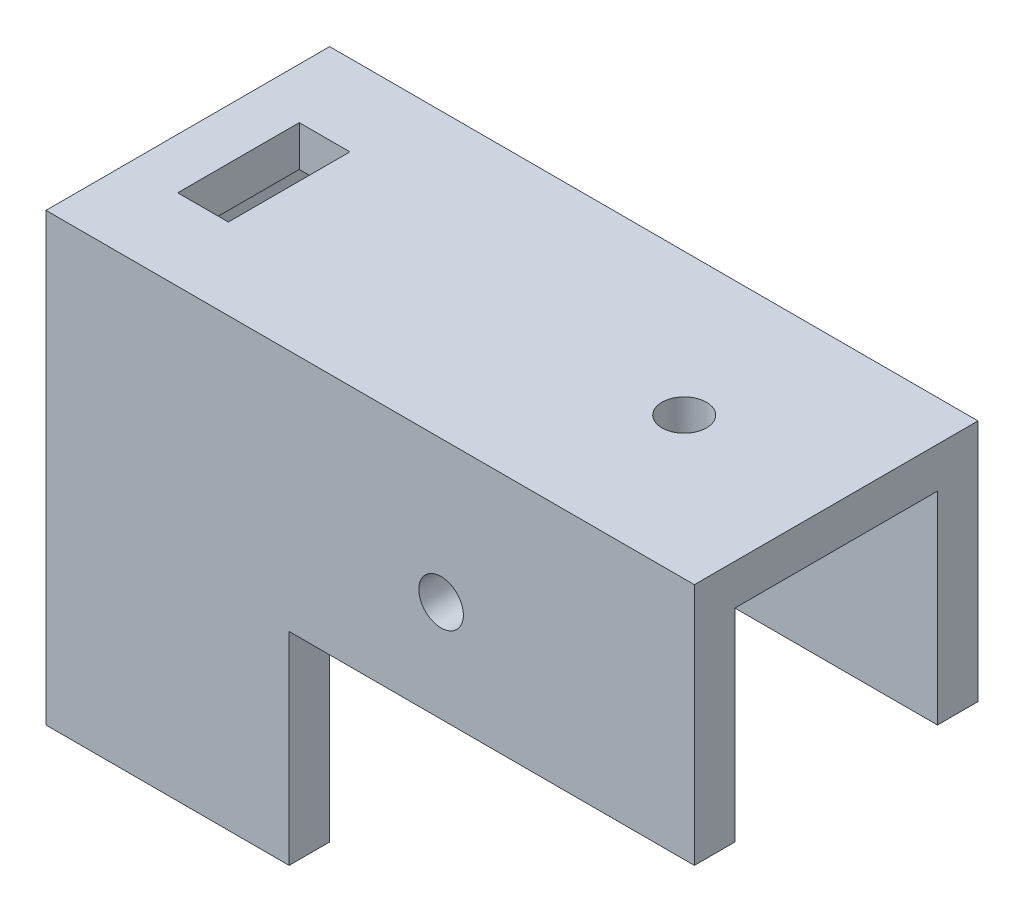
ISO-10303-21;
HEADER;
FILE_DESCRIPTION(('STEP AP214'),'2;1');
FILE_NAME('part.step','',(''),(''),'','','');
FILE_SCHEMA(('AUTOMOTIVE_DESIGN { 1 0 10303 214 1 1 1 1 }'));
ENDSEC;
DATA;
#1=APPLICATION_CONTEXT('core data for automotive mechanical design processes');
#2=APPLICATION_PROTOCOL_DEFINITION('international standard','automotive_design',2000,#1);
#3=PRODUCT_CONTEXT('',#1,'mechanical');
#4=PRODUCT('Part','Part','',(#3));
#5=PRODUCT_RELATED_PRODUCT_CATEGORY('part','',(#4));
#6=PRODUCT_DEFINITION_FORMATION('','',#4);
#7=PRODUCT_DEFINITION_CONTEXT('part definition',#1,'design');
#8=PRODUCT_DEFINITION('design','',#6,#7);
#9=PRODUCT_DEFINITION_SHAPE('','',#8);
#10=(LENGTH_UNIT() NAMED_UNIT(*) SI_UNIT(.MILLI.,.METRE.));
#11=(NAMED_UNIT(*) PLANE_ANGLE_UNIT() SI_UNIT($,.RADIAN.));
#12=(NAMED_UNIT(*) SI_UNIT($,.STERADIAN.) SOLID_ANGLE_UNIT());
#13=UNCERTAINTY_MEASURE_WITH_UNIT(LENGTH_MEASURE(1.E-05),#10,'distance_accuracy_value','');
#14=(GEOMETRIC_REPRESENTATION_CONTEXT(3) GLOBAL_UNCERTAINTY_ASSIGNED_CONTEXT((#13)) GLOBAL_UNIT_ASSIGNED_CONTEXT((#10,
#11,#12)) REPRESENTATION_CONTEXT('',''));
#15=CARTESIAN_POINT('',(0.,0.,0.));
#16=DIRECTION('',(0.,0.,1.));
#17=DIRECTION('',(1.,0.,0.));
#18=AXIS2_PLACEMENT_3D('',#15,#16,#17);
#19=CARTESIAN_POINT('',(24.,-24.,28.));
#20=DIRECTION('',(-1.,0.,0.));
#21=DIRECTION('',(0.,-1.,0.));
#22=AXIS2_PLACEMENT_3D('',#19,#20,#21);
#23=PLANE('',#22);
#24=DIRECTION('',(0.,0.,-1.));
#25=VECTOR('',#24,1.);
#26=CARTESIAN_POINT('',(24.,-24.,28.));
#27=LINE('',#26,#25);
#28=CARTESIAN_POINT('',(24.,-24.,4.));
#29=VERTEX_POINT('',#28);
#30=CARTESIAN_POINT('',(24.,-24.,0.));
#31=VERTEX_POINT('',#30);
#32=EDGE_CURVE('E523',#29,#31,#27,.T.);
#33=ORIENTED_EDGE('',*,*,#32,.F.);
#34=DIRECTION('',(0.,-1.,0.));
#35=VECTOR('',#34,1.);
#36=CARTESIAN_POINT('',(24.,28.2842712474619,4.));
#37=LINE('',#36,#35);
#38=CARTESIAN_POINT('',(24.,-44.,4.));
#39=VERTEX_POINT('',#38);
#40=EDGE_CURVE('E439',#29,#39,#37,.T.);
#41=ORIENTED_EDGE('',*,*,#40,.T.);
#42=DIRECTION('',(0.,0.,-1.));
#43=VECTOR('',#42,1.);
#44=CARTESIAN_POINT('',(24.,-44.,28.));
#45=LINE('',#44,#43);
#46=CARTESIAN_POINT('',(24.,-44.,0.));
#47=VERTEX_POINT('',#46);
#48=EDGE_CURVE('E528',#39,#47,#45,.T.);
#49=ORIENTED_EDGE('',*,*,#48,.T.);
#50=DIRECTION('',(0.,1.,0.));
#51=VECTOR('',#50,1.);
#52=CARTESIAN_POINT('',(24.,-24.,0.));
#53=LINE('',#52,#51);
#54=EDGE_CURVE('E503',#47,#31,#53,.T.);
#55=ORIENTED_EDGE('',*,*,#54,.T.);
#56=EDGE_LOOP('',(#33,#41,#49,#55));
#57=FACE_BOUND('',#56,.T.);
#58=ADVANCED_FACE('F42',(#57),#23,.F.);
#59=CARTESIAN_POINT('',(0.,-44.,28.));
#60=DIRECTION('',(1.,0.,0.));
#61=DIRECTION('',(0.,0.,-1.));
#62=AXIS2_PLACEMENT_3D('',#59,#60,#61);
#63=PLANE('',#62);
#64=CARTESIAN_POINT('',(0.,-15.5,14.));
#65=DIRECTION('',(-1.,0.,0.));
#66=DIRECTION('',(0.,0.,1.));
#67=AXIS2_PLACEMENT_3D('',#64,#65,#66);
#68=CIRCLE('',#67,2.19999999999999);
#69=CARTESIAN_POINT('',(0.,-15.5,16.2));
#70=VERTEX_POINT('',#69);
#71=EDGE_CURVE('E312',#70,#70,#68,.T.);
#72=ORIENTED_EDGE('',*,*,#71,.F.);
#73=EDGE_LOOP('',(#72));
#74=FACE_BOUND('',#73,.T.);
#75=CARTESIAN_POINT('',(0.,-30.5,14.));
#76=DIRECTION('',(-1.,0.,0.));
#77=DIRECTION('',(0.,0.,1.));
#78=AXIS2_PLACEMENT_3D('',#75,#76,#77);
#79=CIRCLE('',#78,2.19999999999999);
#80=CARTESIAN_POINT('',(0.,-30.5,16.2));
#81=VERTEX_POINT('',#80);
#82=EDGE_CURVE('E320',#81,#81,#79,.T.);
#83=ORIENTED_EDGE('',*,*,#82,.F.);
#84=EDGE_LOOP('',(#83));
#85=FACE_BOUND('',#84,.T.);
#86=DIRECTION('',(0.,-1.,0.));
#87=VECTOR('',#86,1.);
#88=CARTESIAN_POINT('',(0.,-44.,0.));
#89=LINE('',#88,#87);
#90=CARTESIAN_POINT('',(0.,0.,0.));
#91=VERTEX_POINT('',#90);
#92=CARTESIAN_POINT('',(0.,-44.,0.));
#93=VERTEX_POINT('',#92);
#94=EDGE_CURVE('E476',#91,#93,#89,.T.);
#95=ORIENTED_EDGE('',*,*,#94,.T.);
#96=DIRECTION('',(0.,0.,-1.));
#97=VECTOR('',#96,1.);
#98=CARTESIAN_POINT('',(0.,-44.,28.));
#99=LINE('',#98,#97);
#100=CARTESIAN_POINT('',(0.,-44.,28.));
#101=VERTEX_POINT('',#100);
#102=EDGE_CURVE('E534',#101,#93,#99,.T.);
#103=ORIENTED_EDGE('',*,*,#102,.F.);
#104=DIRECTION('',(0.,-1.,0.));
#105=VECTOR('',#104,1.);
#106=CARTESIAN_POINT('',(0.,-44.,28.));
#107=LINE('',#106,#105);
#108=CARTESIAN_POINT('',(0.,0.,28.));
#109=VERTEX_POINT('',#108);
#110=EDGE_CURVE('E477',#109,#101,#107,.T.);
#111=ORIENTED_EDGE('',*,*,#110,.F.);
#112=DIRECTION('',(0.,0.,-1.));
#113=VECTOR('',#112,1.);
#114=CARTESIAN_POINT('',(0.,0.,28.));
#115=LINE('',#114,#113);
#116=EDGE_CURVE('E495',#109,#91,#115,.T.);
#117=ORIENTED_EDGE('',*,*,#116,.T.);
#118=EDGE_LOOP('',(#95,#103,#111,#117));
#119=FACE_BOUND('',#118,.T.);
#120=ADVANCED_FACE('F44',(#74,#85,#119),#63,.F.);
#121=CARTESIAN_POINT('',(24.,-44.,28.));
#122=DIRECTION('',(0.,1.,0.));
#123=DIRECTION('',(0.,0.,1.));
#124=AXIS2_PLACEMENT_3D('',#121,#122,#123);
#125=PLANE('',#124);
#126=ORIENTED_EDGE('',*,*,#48,.F.);
#127=DIRECTION('',(1.,0.,0.));
#128=VECTOR('',#127,1.);
#129=CARTESIAN_POINT('',(17.,-44.,4.));
#130=LINE('',#129,#128);
#131=CARTESIAN_POINT('',(17.,-44.,4.));
#132=VERTEX_POINT('',#131);
#133=EDGE_CURVE('E433',#132,#39,#130,.T.);
#134=ORIENTED_EDGE('',*,*,#133,.F.);
#135=DIRECTION('',(0.,0.,-1.));
#136=VECTOR('',#135,1.);
#137=CARTESIAN_POINT('',(17.,-44.,6.5));
#138=LINE('',#137,#136);
#139=CARTESIAN_POINT('',(17.,-44.,6.5));
#140=VERTEX_POINT('',#139);
#141=EDGE_CURVE('E429',#140,#132,#138,.T.);
#142=ORIENTED_EDGE('',*,*,#141,.F.);
#143=DIRECTION('',(1.,0.,0.));
#144=VECTOR('',#143,1.);
#145=CARTESIAN_POINT('',(11.,-44.,6.5));
#146=LINE('',#145,#144);
#147=CARTESIAN_POINT('',(11.,-44.,6.5));
#148=VERTEX_POINT('',#147);
#149=EDGE_CURVE('E425',#148,#140,#146,.T.);
#150=ORIENTED_EDGE('',*,*,#149,.F.);
#151=DIRECTION('',(0.,0.,1.));
#152=VECTOR('',#151,1.);
#153=CARTESIAN_POINT('',(11.,-44.,4.));
#154=LINE('',#153,#152);
#155=CARTESIAN_POINT('',(11.,-44.,4.));
#156=VERTEX_POINT('',#155);
#157=EDGE_CURVE('E421',#156,#148,#154,.T.);
#158=ORIENTED_EDGE('',*,*,#157,.F.);
#159=DIRECTION('',(1.,0.,0.));
#160=VECTOR('',#159,1.);
#161=CARTESIAN_POINT('',(4.,-44.,4.));
#162=LINE('',#161,#160);
#163=CARTESIAN_POINT('',(4.,-44.,4.));
#164=VERTEX_POINT('',#163);
#165=EDGE_CURVE('E417',#164,#156,#162,.T.);
#166=ORIENTED_EDGE('',*,*,#165,.F.);
#167=DIRECTION('',(0.,0.,-1.));
#168=VECTOR('',#167,1.);
#169=CARTESIAN_POINT('',(4.,-44.,24.));
#170=LINE('',#169,#168);
#171=CARTESIAN_POINT('',(4.,-44.,24.));
#172=VERTEX_POINT('',#171);
#173=EDGE_CURVE('E413',#172,#164,#170,.T.);
#174=ORIENTED_EDGE('',*,*,#173,.F.);
#175=DIRECTION('',(-1.,0.,0.));
#176=VECTOR('',#175,1.);
#177=CARTESIAN_POINT('',(11.,-44.,24.));
#178=LINE('',#177,#176);
#179=CARTESIAN_POINT('',(11.,-44.,24.));
#180=VERTEX_POINT('',#179);
#181=EDGE_CURVE('E409',#180,#172,#178,.T.);
#182=ORIENTED_EDGE('',*,*,#181,.F.);
#183=DIRECTION('',(0.,0.,1.));
#184=VECTOR('',#183,1.);
#185=CARTESIAN_POINT('',(11.,-44.,21.5));
#186=LINE('',#185,#184);
#187=CARTESIAN_POINT('',(11.,-44.,21.5));
#188=VERTEX_POINT('',#187);
#189=EDGE_CURVE('E405',#188,#180,#186,.T.);
#190=ORIENTED_EDGE('',*,*,#189,.F.);
#191=DIRECTION('',(-1.,0.,0.));
#192=VECTOR('',#191,1.);
#193=CARTESIAN_POINT('',(17.,-44.,21.5));
#194=LINE('',#193,#192);
#195=CARTESIAN_POINT('',(17.,-44.,21.5));
#196=VERTEX_POINT('',#195);
#197=EDGE_CURVE('E401',#196,#188,#194,.T.);
#198=ORIENTED_EDGE('',*,*,#197,.F.);
#199=DIRECTION('',(0.,0.,-1.));
#200=VECTOR('',#199,1.);
#201=CARTESIAN_POINT('',(17.,-44.,24.));
#202=LINE('',#201,#200);
#203=CARTESIAN_POINT('',(17.,-44.,24.));
#204=VERTEX_POINT('',#203);
#205=EDGE_CURVE('E397',#204,#196,#202,.T.);
#206=ORIENTED_EDGE('',*,*,#205,.F.);
#207=DIRECTION('',(-1.,0.,0.));
#208=VECTOR('',#207,1.);
#209=CARTESIAN_POINT('',(24.,-44.,24.));
#210=LINE('',#209,#208);
#211=CARTESIAN_POINT('',(24.,-44.,24.));
#212=VERTEX_POINT('',#211);
#213=EDGE_CURVE('E359',#212,#204,#210,.T.);
#214=ORIENTED_EDGE('',*,*,#213,.F.);
#215=CARTESIAN_POINT('',(24.,-44.,28.));
#216=VERTEX_POINT('',#215);
#217=EDGE_CURVE('E530',#216,#212,#45,.T.);
#218=ORIENTED_EDGE('',*,*,#217,.F.);
#219=DIRECTION('',(1.,0.,0.));
#220=VECTOR('',#219,1.);
#221=CARTESIAN_POINT('',(24.,-44.,28.));
#222=LINE('',#221,#220);
#223=EDGE_CURVE('E481',#101,#216,#222,.T.);
#224=ORIENTED_EDGE('',*,*,#223,.F.);
#225=ORIENTED_EDGE('',*,*,#102,.T.);
#226=DIRECTION('',(1.,0.,0.));
#227=VECTOR('',#226,1.);
#228=CARTESIAN_POINT('',(24.,-44.,0.));
#229=LINE('',#228,#227);
#230=EDGE_CURVE('E499',#93,#47,#229,.T.);
#231=ORIENTED_EDGE('',*,*,#230,.T.);
#232=EDGE_LOOP('',(#126,#134,#142,#150,#158,#166,#174,#182,#190,#198,#206,#214,#218,#224,#225,#231));
#233=FACE_BOUND('',#232,.T.);
#234=ADVANCED_FACE('F574',(#233),#125,.F.);
#235=ORIENTED_EDGE('',*,*,#217,.T.);
#236=DIRECTION('',(0.,-1.,0.));
#237=VECTOR('',#236,1.);
#238=CARTESIAN_POINT('',(24.,28.2842712474619,24.));
#239=LINE('',#238,#237);
#240=CARTESIAN_POINT('',(24.,-24.,24.));
#241=VERTEX_POINT('',#240);
#242=EDGE_CURVE('E436',#241,#212,#239,.T.);
#243=ORIENTED_EDGE('',*,*,#242,.F.);
#244=CARTESIAN_POINT('',(24.,-24.,28.));
#245=VERTEX_POINT('',#244);
#246=EDGE_CURVE('E524',#245,#241,#27,.T.);
#247=ORIENTED_EDGE('',*,*,#246,.F.);
#248=DIRECTION('',(0.,1.,0.));
#249=VECTOR('',#248,1.);
#250=CARTESIAN_POINT('',(24.,-24.,28.));
#251=LINE('',#250,#249);
#252=EDGE_CURVE('E485',#216,#245,#251,.T.);
#253=ORIENTED_EDGE('',*,*,#252,.F.);
#254=EDGE_LOOP('',(#235,#243,#247,#253));
#255=FACE_BOUND('',#254,.T.);
#256=ADVANCED_FACE('F570',(#255),#23,.F.);
#257=CARTESIAN_POINT('',(64.,-24.,28.));
#258=DIRECTION('',(0.,1.,0.));
#259=DIRECTION('',(0.,0.,1.));
#260=AXIS2_PLACEMENT_3D('',#257,#258,#259);
#261=PLANE('',#260);
#262=DIRECTION('',(0.,0.,-1.));
#263=VECTOR('',#262,1.);
#264=CARTESIAN_POINT('',(64.,-24.,28.));
#265=LINE('',#264,#263);
#266=CARTESIAN_POINT('',(64.,-24.,4.));
#267=VERTEX_POINT('',#266);
#268=CARTESIAN_POINT('',(64.,-24.,0.));
#269=VERTEX_POINT('',#268);
#270=EDGE_CURVE('E519',#267,#269,#265,.T.);
#271=ORIENTED_EDGE('',*,*,#270,.F.);
#272=DIRECTION('',(1.,0.,0.));
#273=VECTOR('',#272,1.);
#274=CARTESIAN_POINT('',(64.,-24.,4.));
#275=LINE('',#274,#273);
#276=CARTESIAN_POINT('',(31.,-24.,3.99999999999999));
#277=VERTEX_POINT('',#276);
#278=EDGE_CURVE('E345',#277,#267,#275,.T.);
#279=ORIENTED_EDGE('',*,*,#278,.F.);
#280=DIRECTION('',(0.,0.,-1.));
#281=VECTOR('',#280,1.);
#282=CARTESIAN_POINT('',(31.,-24.,24.));
#283=LINE('',#282,#281);
#284=CARTESIAN_POINT('',(31.,-24.,24.));
#285=VERTEX_POINT('',#284);
#286=EDGE_CURVE('E341',#285,#277,#283,.T.);
#287=ORIENTED_EDGE('',*,*,#286,.F.);
#288=DIRECTION('',(-1.,0.,0.));
#289=VECTOR('',#288,1.);
#290=CARTESIAN_POINT('',(64.,-24.,24.));
#291=LINE('',#290,#289);
#292=CARTESIAN_POINT('',(64.,-24.,24.));
#293=VERTEX_POINT('',#292);
#294=EDGE_CURVE('E328',#293,#285,#291,.T.);
#295=ORIENTED_EDGE('',*,*,#294,.F.);
#296=CARTESIAN_POINT('',(64.,-24.,28.));
#297=VERTEX_POINT('',#296);
#298=EDGE_CURVE('E520',#297,#293,#265,.T.);
#299=ORIENTED_EDGE('',*,*,#298,.F.);
#300=DIRECTION('',(1.,0.,0.));
#301=VECTOR('',#300,1.);
#302=CARTESIAN_POINT('',(64.,-24.,28.));
#303=LINE('',#302,#301);
#304=EDGE_CURVE('E488',#245,#297,#303,.T.);
#305=ORIENTED_EDGE('',*,*,#304,.F.);
#306=ORIENTED_EDGE('',*,*,#246,.T.);
#307=EDGE_CURVE('E529',#241,#29,#27,.T.);
#308=ORIENTED_EDGE('',*,*,#307,.T.);
#309=ORIENTED_EDGE('',*,*,#32,.T.);
#310=DIRECTION('',(1.,0.,0.));
#311=VECTOR('',#310,1.);
#312=CARTESIAN_POINT('',(64.,-24.,0.));
#313=LINE('',#312,#311);
#314=EDGE_CURVE('E507',#31,#269,#313,.T.);
#315=ORIENTED_EDGE('',*,*,#314,.T.);
#316=EDGE_LOOP('',(#271,#279,#287,#295,#299,#305,#306,#308,#309,#315));
#317=FACE_BOUND('',#316,.T.);
#318=ADVANCED_FACE('F579',(#317),#261,.F.);
#319=CARTESIAN_POINT('',(64.,0.,28.));
#320=DIRECTION('',(-1.,0.,0.));
#321=DIRECTION('',(0.,0.,1.));
#322=AXIS2_PLACEMENT_3D('',#319,#320,#321);
#323=PLANE('',#322);
#324=DIRECTION('',(0.,0.,-1.));
#325=VECTOR('',#324,1.);
#326=CARTESIAN_POINT('',(64.,-4.,24.));
#327=LINE('',#326,#325);
#328=CARTESIAN_POINT('',(64.,-4.,24.));
#329=VERTEX_POINT('',#328);
#330=CARTESIAN_POINT('',(64.,-4.,4.));
#331=VERTEX_POINT('',#330);
#332=EDGE_CURVE('E334',#329,#331,#327,.T.);
#333=ORIENTED_EDGE('',*,*,#332,.T.);
#334=DIRECTION('',(0.,-1.,0.));
#335=VECTOR('',#334,1.);
#336=CARTESIAN_POINT('',(64.,38.5875627631495,4.));
#337=LINE('',#336,#335);
#338=EDGE_CURVE('E332',#331,#267,#337,.T.);
#339=ORIENTED_EDGE('',*,*,#338,.T.);
#340=ORIENTED_EDGE('',*,*,#270,.T.);
#341=DIRECTION('',(0.,1.,0.));
#342=VECTOR('',#341,1.);
#343=CARTESIAN_POINT('',(64.,0.,0.));
#344=LINE('',#343,#342);
#345=CARTESIAN_POINT('',(64.,0.,0.));
#346=VERTEX_POINT('',#345);
#347=EDGE_CURVE('E511',#269,#346,#344,.T.);
#348=ORIENTED_EDGE('',*,*,#347,.T.);
#349=DIRECTION('',(0.,0.,-1.));
#350=VECTOR('',#349,1.);
#351=CARTESIAN_POINT('',(64.,0.,28.));
#352=LINE('',#351,#350);
#353=CARTESIAN_POINT('',(64.,0.,28.));
#354=VERTEX_POINT('',#353);
#355=EDGE_CURVE('E516',#354,#346,#352,.T.);
#356=ORIENTED_EDGE('',*,*,#355,.F.);
#357=DIRECTION('',(0.,1.,0.));
#358=VECTOR('',#357,1.);
#359=CARTESIAN_POINT('',(64.,0.,28.));
#360=LINE('',#359,#358);
#361=EDGE_CURVE('E491',#297,#354,#360,.T.);
#362=ORIENTED_EDGE('',*,*,#361,.F.);
#363=ORIENTED_EDGE('',*,*,#298,.T.);
#364=DIRECTION('',(0.,-1.,0.));
#365=VECTOR('',#364,1.);
#366=CARTESIAN_POINT('',(64.,38.5875627631495,24.));
#367=LINE('',#366,#365);
#368=EDGE_CURVE('E348',#329,#293,#367,.T.);
#369=ORIENTED_EDGE('',*,*,#368,.F.);
#370=EDGE_LOOP('',(#333,#339,#340,#348,#356,#362,#363,#369));
#371=FACE_BOUND('',#370,.T.);
#372=ADVANCED_FACE('F585',(#371),#323,.F.);
#373=CARTESIAN_POINT('',(0.,0.,28.));
#374=DIRECTION('',(0.,-1.,0.));
#375=DIRECTION('',(0.,0.,-1.));
#376=AXIS2_PLACEMENT_3D('',#373,#374,#375);
#377=PLANE('',#376);
#378=DIRECTION('',(-1.,0.,0.));
#379=VECTOR('',#378,1.);
#380=CARTESIAN_POINT('',(10.,0.,8.));
#381=LINE('',#380,#379);
#382=CARTESIAN_POINT('',(10.,0.,8.));
#383=VERTEX_POINT('',#382);
#384=CARTESIAN_POINT('',(5.,0.,8.));
#385=VERTEX_POINT('',#384);
#386=EDGE_CURVE('E272',#383,#385,#381,.T.);
#387=ORIENTED_EDGE('',*,*,#386,.F.);
#388=DIRECTION('',(0.,0.,-1.));
#389=VECTOR('',#388,1.);
#390=CARTESIAN_POINT('',(10.,0.,8.));
#391=LINE('',#390,#389);
#392=CARTESIAN_POINT('',(10.,0.,20.));
#393=VERTEX_POINT('',#392);
#394=EDGE_CURVE('E58',#393,#383,#391,.T.);
#395=ORIENTED_EDGE('',*,*,#394,.F.);
#396=DIRECTION('',(1.,0.,0.));
#397=VECTOR('',#396,1.);
#398=CARTESIAN_POINT('',(10.,0.,20.));
#399=LINE('',#398,#397);
#400=CARTESIAN_POINT('',(5.,0.,20.));
#401=VERTEX_POINT('',#400);
#402=EDGE_CURVE('E279',#401,#393,#399,.T.);
#403=ORIENTED_EDGE('',*,*,#402,.F.);
#404=DIRECTION('',(0.,0.,1.));
#405=VECTOR('',#404,1.);
#406=CARTESIAN_POINT('',(5.,0.,8.));
#407=LINE('',#406,#405);
#408=EDGE_CURVE('E262',#385,#401,#407,.T.);
#409=ORIENTED_EDGE('',*,*,#408,.F.);
#410=EDGE_LOOP('',(#387,#395,#403,#409));
#411=FACE_BOUND('',#410,.T.);
#412=CARTESIAN_POINT('',(49.,0.,14.));
#413=DIRECTION('',(0.,1.,0.));
#414=DIRECTION('',(0.,0.,1.));
#415=AXIS2_PLACEMENT_3D('',#412,#413,#414);
#416=CIRCLE('',#415,2.19999999999999);
#417=CARTESIAN_POINT('',(49.,0.,16.2));
#418=VERTEX_POINT('',#417);
#419=EDGE_CURVE('E290',#418,#418,#416,.T.);
#420=ORIENTED_EDGE('',*,*,#419,.F.);
#421=EDGE_LOOP('',(#420));
#422=FACE_BOUND('',#421,.T.);
#423=DIRECTION('',(-1.,0.,0.));
#424=VECTOR('',#423,1.);
#425=CARTESIAN_POINT('',(0.,0.,0.));
#426=LINE('',#425,#424);
#427=EDGE_CURVE('E482',#346,#91,#426,.T.);
#428=ORIENTED_EDGE('',*,*,#427,.T.);
#429=ORIENTED_EDGE('',*,*,#116,.F.);
#430=DIRECTION('',(-1.,0.,0.));
#431=VECTOR('',#430,1.);
#432=CARTESIAN_POINT('',(0.,0.,28.));
#433=LINE('',#432,#431);
#434=EDGE_CURVE('E493',#354,#109,#433,.T.);
#435=ORIENTED_EDGE('',*,*,#434,.F.);
#436=ORIENTED_EDGE('',*,*,#355,.T.);
#437=EDGE_LOOP('',(#428,#429,#435,#436));
#438=FACE_BOUND('',#437,.T.);
#439=ADVANCED_FACE('F276',(#411,#422,#438),#377,.F.);
#440=CARTESIAN_POINT('',(0.,0.,28.));
#441=DIRECTION('',(0.,0.,-1.));
#442=DIRECTION('',(-1.,0.,0.));
#443=AXIS2_PLACEMENT_3D('',#440,#441,#442);
#444=PLANE('',#443);
#445=CARTESIAN_POINT('',(39.,-14.,28.));
#446=DIRECTION('',(0.,0.,1.));
#447=DIRECTION('',(1.,0.,0.));
#448=AXIS2_PLACEMENT_3D('',#445,#446,#447);
#449=CIRCLE('',#448,2.19999999999999);
#450=CARTESIAN_POINT('',(41.2,-14.,28.));
#451=VERTEX_POINT('',#450);
#452=EDGE_CURVE('E300',#451,#451,#449,.T.);
#453=ORIENTED_EDGE('',*,*,#452,.F.);
#454=EDGE_LOOP('',(#453));
#455=FACE_BOUND('',#454,.T.);
#456=ORIENTED_EDGE('',*,*,#110,.T.);
#457=ORIENTED_EDGE('',*,*,#223,.T.);
#458=ORIENTED_EDGE('',*,*,#252,.T.);
#459=ORIENTED_EDGE('',*,*,#304,.T.);
#460=ORIENTED_EDGE('',*,*,#361,.T.);
#461=ORIENTED_EDGE('',*,*,#434,.T.);
#462=EDGE_LOOP('',(#456,#457,#458,#459,#460,#461));
#463=FACE_BOUND('',#462,.T.);
#464=ADVANCED_FACE('F622',(#455,#463),#444,.F.);
#465=CARTESIAN_POINT('',(0.,0.,0.));
#466=DIRECTION('',(0.,0.,-1.));
#467=DIRECTION('',(-1.,0.,0.));
#468=AXIS2_PLACEMENT_3D('',#465,#466,#467);
#469=PLANE('',#468);
#470=CARTESIAN_POINT('',(39.,-14.,0.));
#471=DIRECTION('',(0.,0.,1.));
#472=DIRECTION('',(1.,0.,0.));
#473=AXIS2_PLACEMENT_3D('',#470,#471,#472);
#474=CIRCLE('',#473,2.19999999999999);
#475=CARTESIAN_POINT('',(41.2,-14.,0.));
#476=VERTEX_POINT('',#475);
#477=EDGE_CURVE('E303',#476,#476,#474,.T.);
#478=ORIENTED_EDGE('',*,*,#477,.T.);
#479=EDGE_LOOP('',(#478));
#480=FACE_BOUND('',#479,.T.);
#481=ORIENTED_EDGE('',*,*,#94,.F.);
#482=ORIENTED_EDGE('',*,*,#427,.F.);
#483=ORIENTED_EDGE('',*,*,#347,.F.);
#484=ORIENTED_EDGE('',*,*,#314,.F.);
#485=ORIENTED_EDGE('',*,*,#54,.F.);
#486=ORIENTED_EDGE('',*,*,#230,.F.);
#487=EDGE_LOOP('',(#481,#482,#483,#484,#485,#486));
#488=FACE_BOUND('',#487,.T.);
#489=ADVANCED_FACE('F612',(#480,#488),#469,.T.);
#490=CARTESIAN_POINT('',(24.,28.2842712474619,4.));
#491=DIRECTION('',(1.,0.,0.));
#492=DIRECTION('',(0.,0.,-1.));
#493=AXIS2_PLACEMENT_3D('',#490,#491,#492);
#494=PLANE('',#493);
#495=CARTESIAN_POINT('',(24.,-4.,24.));
#496=VERTEX_POINT('',#495);
#497=EDGE_CURVE('E470',#496,#241,#239,.T.);
#498=ORIENTED_EDGE('',*,*,#497,.F.);
#499=DIRECTION('',(0.,0.,-1.));
#500=VECTOR('',#499,1.);
#501=CARTESIAN_POINT('',(24.,-4.,4.));
#502=LINE('',#501,#500);
#503=CARTESIAN_POINT('',(24.,-4.,4.));
#504=VERTEX_POINT('',#503);
#505=EDGE_CURVE('E390',#496,#504,#502,.T.);
#506=ORIENTED_EDGE('',*,*,#505,.T.);
#507=EDGE_CURVE('E364',#504,#29,#37,.T.);
#508=ORIENTED_EDGE('',*,*,#507,.T.);
#509=ORIENTED_EDGE('',*,*,#307,.F.);
#510=EDGE_LOOP('',(#498,#506,#508,#509));
#511=FACE_BOUND('',#510,.T.);
#512=ADVANCED_FACE('F663',(#511),#494,.F.);
#513=CARTESIAN_POINT('',(17.,28.2842712474619,4.));
#514=DIRECTION('',(0.,0.,-1.));
#515=DIRECTION('',(-1.,0.,0.));
#516=AXIS2_PLACEMENT_3D('',#513,#514,#515);
#517=PLANE('',#516);
#518=DIRECTION('',(-1.,0.,0.));
#519=VECTOR('',#518,1.);
#520=CARTESIAN_POINT('',(17.,-4.,4.));
#521=LINE('',#520,#519);
#522=CARTESIAN_POINT('',(17.,-4.,4.));
#523=VERTEX_POINT('',#522);
#524=EDGE_CURVE('E387',#504,#523,#521,.T.);
#525=ORIENTED_EDGE('',*,*,#524,.T.);
#526=DIRECTION('',(0.,-1.,0.));
#527=VECTOR('',#526,1.);
#528=CARTESIAN_POINT('',(17.,28.2842712474619,4.));
#529=LINE('',#528,#527);
#530=EDGE_CURVE('E440',#523,#132,#529,.T.);
#531=ORIENTED_EDGE('',*,*,#530,.T.);
#532=ORIENTED_EDGE('',*,*,#133,.T.);
#533=ORIENTED_EDGE('',*,*,#40,.F.);
#534=ORIENTED_EDGE('',*,*,#507,.F.);
#535=EDGE_LOOP('',(#525,#531,#532,#533,#534));
#536=FACE_BOUND('',#535,.T.);
#537=ADVANCED_FACE('F660',(#536),#517,.F.);
#538=CARTESIAN_POINT('',(17.,28.2842712474619,6.5));
#539=DIRECTION('',(-1.,0.,0.));
#540=DIRECTION('',(0.,0.,1.));
#541=AXIS2_PLACEMENT_3D('',#538,#539,#540);
#542=PLANE('',#541);
#543=DIRECTION('',(0.,0.,1.));
#544=VECTOR('',#543,1.);
#545=CARTESIAN_POINT('',(17.,-4.,6.5));
#546=LINE('',#545,#544);
#547=CARTESIAN_POINT('',(17.,-4.,6.5));
#548=VERTEX_POINT('',#547);
#549=EDGE_CURVE('E384',#523,#548,#546,.T.);
#550=ORIENTED_EDGE('',*,*,#549,.T.);
#551=DIRECTION('',(0.,-1.,0.));
#552=VECTOR('',#551,1.);
#553=CARTESIAN_POINT('',(17.,28.2842712474619,6.5));
#554=LINE('',#553,#552);
#555=EDGE_CURVE('E443',#548,#140,#554,.T.);
#556=ORIENTED_EDGE('',*,*,#555,.T.);
#557=ORIENTED_EDGE('',*,*,#141,.T.);
#558=ORIENTED_EDGE('',*,*,#530,.F.);
#559=EDGE_LOOP('',(#550,#556,#557,#558));
#560=FACE_BOUND('',#559,.T.);
#561=ADVANCED_FACE('F662',(#560),#542,.F.);
#562=CARTESIAN_POINT('',(11.,28.2842712474619,6.5));
#563=DIRECTION('',(0.,0.,-1.));
#564=DIRECTION('',(-1.,0.,0.));
#565=AXIS2_PLACEMENT_3D('',#562,#563,#564);
#566=PLANE('',#565);
#567=DIRECTION('',(-1.,0.,0.));
#568=VECTOR('',#567,1.);
#569=CARTESIAN_POINT('',(11.,-4.,6.5));
#570=LINE('',#569,#568);
#571=CARTESIAN_POINT('',(11.,-4.,6.5));
#572=VERTEX_POINT('',#571);
#573=EDGE_CURVE('E381',#548,#572,#570,.T.);
#574=ORIENTED_EDGE('',*,*,#573,.T.);
#575=DIRECTION('',(0.,-1.,0.));
#576=VECTOR('',#575,1.);
#577=CARTESIAN_POINT('',(11.,28.2842712474619,6.5));
#578=LINE('',#577,#576);
#579=EDGE_CURVE('E446',#572,#148,#578,.T.);
#580=ORIENTED_EDGE('',*,*,#579,.T.);
#581=ORIENTED_EDGE('',*,*,#149,.T.);
#582=ORIENTED_EDGE('',*,*,#555,.F.);
#583=EDGE_LOOP('',(#574,#580,#581,#582));
#584=FACE_BOUND('',#583,.T.);
#585=ADVANCED_FACE('F667',(#584),#566,.F.);
#586=CARTESIAN_POINT('',(11.,28.2842712474619,4.));
#587=DIRECTION('',(1.,0.,0.));
#588=DIRECTION('',(0.,0.,-1.));
#589=AXIS2_PLACEMENT_3D('',#586,#587,#588);
#590=PLANE('',#589);
#591=DIRECTION('',(0.,0.,-1.));
#592=VECTOR('',#591,1.);
#593=CARTESIAN_POINT('',(11.,-4.,4.));
#594=LINE('',#593,#592);
#595=CARTESIAN_POINT('',(11.,-4.,4.));
#596=VERTEX_POINT('',#595);
#597=EDGE_CURVE('E378',#572,#596,#594,.T.);
#598=ORIENTED_EDGE('',*,*,#597,.T.);
#599=DIRECTION('',(0.,-1.,0.));
#600=VECTOR('',#599,1.);
#601=CARTESIAN_POINT('',(11.,28.2842712474619,4.));
#602=LINE('',#601,#600);
#603=EDGE_CURVE('E449',#596,#156,#602,.T.);
#604=ORIENTED_EDGE('',*,*,#603,.T.);
#605=ORIENTED_EDGE('',*,*,#157,.T.);
#606=ORIENTED_EDGE('',*,*,#579,.F.);
#607=EDGE_LOOP('',(#598,#604,#605,#606));
#608=FACE_BOUND('',#607,.T.);
#609=ADVANCED_FACE('F671',(#608),#590,.F.);
#610=CARTESIAN_POINT('',(4.,28.2842712474619,4.));
#611=DIRECTION('',(0.,0.,-1.));
#612=DIRECTION('',(-1.,0.,0.));
#613=AXIS2_PLACEMENT_3D('',#610,#611,#612);
#614=PLANE('',#613);
#615=DIRECTION('',(-1.,0.,0.));
#616=VECTOR('',#615,1.);
#617=CARTESIAN_POINT('',(4.,-4.,4.));
#618=LINE('',#617,#616);
#619=CARTESIAN_POINT('',(4.,-4.,4.));
#620=VERTEX_POINT('',#619);
#621=EDGE_CURVE('E375',#596,#620,#618,.T.);
#622=ORIENTED_EDGE('',*,*,#621,.T.);
#623=DIRECTION('',(0.,-1.,0.));
#624=VECTOR('',#623,1.);
#625=CARTESIAN_POINT('',(4.,28.2842712474619,4.));
#626=LINE('',#625,#624);
#627=EDGE_CURVE('E452',#620,#164,#626,.T.);
#628=ORIENTED_EDGE('',*,*,#627,.T.);
#629=ORIENTED_EDGE('',*,*,#165,.T.);
#630=ORIENTED_EDGE('',*,*,#603,.F.);
#631=EDGE_LOOP('',(#622,#628,#629,#630));
#632=FACE_BOUND('',#631,.T.);
#633=ADVANCED_FACE('F675',(#632),#614,.F.);
#634=CARTESIAN_POINT('',(4.,28.2842712474619,24.));
#635=DIRECTION('',(-1.,0.,0.));
#636=DIRECTION('',(0.,0.,1.));
#637=AXIS2_PLACEMENT_3D('',#634,#635,#636);
#638=PLANE('',#637);
#639=CARTESIAN_POINT('',(4.,-15.5,14.));
#640=DIRECTION('',(-1.,0.,0.));
#641=DIRECTION('',(0.,0.,1.));
#642=AXIS2_PLACEMENT_3D('',#639,#640,#641);
#643=CIRCLE('',#642,2.19999999999999);
#644=CARTESIAN_POINT('',(4.,-15.5,16.2));
#645=VERTEX_POINT('',#644);
#646=EDGE_CURVE('E316',#645,#645,#643,.T.);
#647=ORIENTED_EDGE('',*,*,#646,.T.);
#648=EDGE_LOOP('',(#647));
#649=FACE_BOUND('',#648,.T.);
#650=CARTESIAN_POINT('',(4.,-30.5,14.));
#651=DIRECTION('',(-1.,0.,0.));
#652=DIRECTION('',(0.,0.,1.));
#653=AXIS2_PLACEMENT_3D('',#650,#651,#652);
#654=CIRCLE('',#653,2.19999999999999);
#655=CARTESIAN_POINT('',(4.,-30.5,16.2));
#656=VERTEX_POINT('',#655);
#657=EDGE_CURVE('E324',#656,#656,#654,.T.);
#658=ORIENTED_EDGE('',*,*,#657,.T.);
#659=EDGE_LOOP('',(#658));
#660=FACE_BOUND('',#659,.T.);
#661=DIRECTION('',(0.,0.,1.));
#662=VECTOR('',#661,1.);
#663=CARTESIAN_POINT('',(4.,-4.,24.));
#664=LINE('',#663,#662);
#665=CARTESIAN_POINT('',(4.,-4.,24.));
#666=VERTEX_POINT('',#665);
#667=EDGE_CURVE('E372',#620,#666,#664,.T.);
#668=ORIENTED_EDGE('',*,*,#667,.T.);
#669=DIRECTION('',(0.,-1.,0.));
#670=VECTOR('',#669,1.);
#671=CARTESIAN_POINT('',(4.,28.2842712474619,24.));
#672=LINE('',#671,#670);
#673=EDGE_CURVE('E455',#666,#172,#672,.T.);
#674=ORIENTED_EDGE('',*,*,#673,.T.);
#675=ORIENTED_EDGE('',*,*,#173,.T.);
#676=ORIENTED_EDGE('',*,*,#627,.F.);
#677=EDGE_LOOP('',(#668,#674,#675,#676));
#678=FACE_BOUND('',#677,.T.);
#679=ADVANCED_FACE('F679',(#649,#660,#678),#638,.F.);
#680=CARTESIAN_POINT('',(11.,28.2842712474619,24.));
#681=DIRECTION('',(0.,0.,1.));
#682=DIRECTION('',(1.,0.,0.));
#683=AXIS2_PLACEMENT_3D('',#680,#681,#682);
#684=PLANE('',#683);
#685=DIRECTION('',(1.,0.,0.));
#686=VECTOR('',#685,1.);
#687=CARTESIAN_POINT('',(11.,-4.,24.));
#688=LINE('',#687,#686);
#689=CARTESIAN_POINT('',(11.,-4.,24.));
#690=VERTEX_POINT('',#689);
#691=EDGE_CURVE('E369',#666,#690,#688,.T.);
#692=ORIENTED_EDGE('',*,*,#691,.T.);
#693=DIRECTION('',(0.,-1.,0.));
#694=VECTOR('',#693,1.);
#695=CARTESIAN_POINT('',(11.,28.2842712474619,24.));
#696=LINE('',#695,#694);
#697=EDGE_CURVE('E458',#690,#180,#696,.T.);
#698=ORIENTED_EDGE('',*,*,#697,.T.);
#699=ORIENTED_EDGE('',*,*,#181,.T.);
#700=ORIENTED_EDGE('',*,*,#673,.F.);
#701=EDGE_LOOP('',(#692,#698,#699,#700));
#702=FACE_BOUND('',#701,.T.);
#703=ADVANCED_FACE('F683',(#702),#684,.F.);
#704=CARTESIAN_POINT('',(11.,28.2842712474619,21.5));
#705=DIRECTION('',(1.,0.,0.));
#706=DIRECTION('',(0.,0.,-1.));
#707=AXIS2_PLACEMENT_3D('',#704,#705,#706);
#708=PLANE('',#707);
#709=DIRECTION('',(0.,0.,-1.));
#710=VECTOR('',#709,1.);
#711=CARTESIAN_POINT('',(11.,-4.,21.5));
#712=LINE('',#711,#710);
#713=CARTESIAN_POINT('',(11.,-4.,21.5));
#714=VERTEX_POINT('',#713);
#715=EDGE_CURVE('E367',#690,#714,#712,.T.);
#716=ORIENTED_EDGE('',*,*,#715,.T.);
#717=DIRECTION('',(0.,-1.,0.));
#718=VECTOR('',#717,1.);
#719=CARTESIAN_POINT('',(11.,28.2842712474619,21.5));
#720=LINE('',#719,#718);
#721=EDGE_CURVE('E461',#714,#188,#720,.T.);
#722=ORIENTED_EDGE('',*,*,#721,.T.);
#723=ORIENTED_EDGE('',*,*,#189,.T.);
#724=ORIENTED_EDGE('',*,*,#697,.F.);
#725=EDGE_LOOP('',(#716,#722,#723,#724));
#726=FACE_BOUND('',#725,.T.);
#727=ADVANCED_FACE('F687',(#726),#708,.F.);
#728=CARTESIAN_POINT('',(17.,28.2842712474619,21.5));
#729=DIRECTION('',(0.,0.,1.));
#730=DIRECTION('',(1.,0.,0.));
#731=AXIS2_PLACEMENT_3D('',#728,#729,#730);
#732=PLANE('',#731);
#733=DIRECTION('',(1.,0.,0.));
#734=VECTOR('',#733,1.);
#735=CARTESIAN_POINT('',(17.,-4.,21.5));
#736=LINE('',#735,#734);
#737=CARTESIAN_POINT('',(17.,-4.,21.5));
#738=VERTEX_POINT('',#737);
#739=EDGE_CURVE('E363',#714,#738,#736,.T.);
#740=ORIENTED_EDGE('',*,*,#739,.T.);
#741=DIRECTION('',(0.,-1.,0.));
#742=VECTOR('',#741,1.);
#743=CARTESIAN_POINT('',(17.,28.2842712474619,21.5));
#744=LINE('',#743,#742);
#745=EDGE_CURVE('E464',#738,#196,#744,.T.);
#746=ORIENTED_EDGE('',*,*,#745,.T.);
#747=ORIENTED_EDGE('',*,*,#197,.T.);
#748=ORIENTED_EDGE('',*,*,#721,.F.);
#749=EDGE_LOOP('',(#740,#746,#747,#748));
#750=FACE_BOUND('',#749,.T.);
#751=ADVANCED_FACE('F691',(#750),#732,.F.);
#752=CARTESIAN_POINT('',(17.,28.2842712474619,24.));
#753=DIRECTION('',(-1.,0.,0.));
#754=DIRECTION('',(0.,0.,1.));
#755=AXIS2_PLACEMENT_3D('',#752,#753,#754);
#756=PLANE('',#755);
#757=DIRECTION('',(0.,0.,1.));
#758=VECTOR('',#757,1.);
#759=CARTESIAN_POINT('',(17.,-4.,24.));
#760=LINE('',#759,#758);
#761=CARTESIAN_POINT('',(17.,-4.,24.));
#762=VERTEX_POINT('',#761);
#763=EDGE_CURVE('E360',#738,#762,#760,.T.);
#764=ORIENTED_EDGE('',*,*,#763,.T.);
#765=DIRECTION('',(0.,-1.,0.));
#766=VECTOR('',#765,1.);
#767=CARTESIAN_POINT('',(17.,28.2842712474619,24.));
#768=LINE('',#767,#766);
#769=EDGE_CURVE('E467',#762,#204,#768,.T.);
#770=ORIENTED_EDGE('',*,*,#769,.T.);
#771=ORIENTED_EDGE('',*,*,#205,.T.);
#772=ORIENTED_EDGE('',*,*,#745,.F.);
#773=EDGE_LOOP('',(#764,#770,#771,#772));
#774=FACE_BOUND('',#773,.T.);
#775=ADVANCED_FACE('F695',(#774),#756,.F.);
#776=CARTESIAN_POINT('',(24.,28.2842712474619,24.));
#777=DIRECTION('',(0.,0.,1.));
#778=DIRECTION('',(1.,0.,0.));
#779=AXIS2_PLACEMENT_3D('',#776,#777,#778);
#780=PLANE('',#779);
#781=DIRECTION('',(1.,0.,0.));
#782=VECTOR('',#781,1.);
#783=CARTESIAN_POINT('',(24.,-4.,24.));
#784=LINE('',#783,#782);
#785=EDGE_CURVE('E393',#762,#496,#784,.T.);
#786=ORIENTED_EDGE('',*,*,#785,.T.);
#787=ORIENTED_EDGE('',*,*,#497,.T.);
#788=ORIENTED_EDGE('',*,*,#242,.T.);
#789=ORIENTED_EDGE('',*,*,#213,.T.);
#790=ORIENTED_EDGE('',*,*,#769,.F.);
#791=EDGE_LOOP('',(#786,#787,#788,#789,#790));
#792=FACE_BOUND('',#791,.T.);
#793=ADVANCED_FACE('F598',(#792),#780,.F.);
#794=CARTESIAN_POINT('',(0.,-4.,28.));
#795=DIRECTION('',(0.,-1.,0.));
#796=DIRECTION('',(0.,0.,-1.));
#797=AXIS2_PLACEMENT_3D('',#794,#795,#796);
#798=PLANE('',#797);
#799=DIRECTION('',(0.,0.,1.));
#800=VECTOR('',#799,1.);
#801=CARTESIAN_POINT('',(10.,-4.,28.));
#802=LINE('',#801,#800);
#803=CARTESIAN_POINT('',(10.,-4.,8.));
#804=VERTEX_POINT('',#803);
#805=CARTESIAN_POINT('',(10.,-4.,20.));
#806=VERTEX_POINT('',#805);
#807=EDGE_CURVE('E12',#804,#806,#802,.T.);
#808=ORIENTED_EDGE('',*,*,#807,.F.);
#809=DIRECTION('',(1.,0.,0.));
#810=VECTOR('',#809,1.);
#811=CARTESIAN_POINT('',(0.,-4.,8.));
#812=LINE('',#811,#810);
#813=CARTESIAN_POINT('',(5.,-4.,8.));
#814=VERTEX_POINT('',#813);
#815=EDGE_CURVE('E538',#814,#804,#812,.T.);
#816=ORIENTED_EDGE('',*,*,#815,.F.);
#817=DIRECTION('',(0.,0.,-1.));
#818=VECTOR('',#817,1.);
#819=CARTESIAN_POINT('',(4.99999999999999,-4.,28.));
#820=LINE('',#819,#818);
#821=CARTESIAN_POINT('',(5.,-4.,20.));
#822=VERTEX_POINT('',#821);
#823=EDGE_CURVE('E265',#822,#814,#820,.T.);
#824=ORIENTED_EDGE('',*,*,#823,.F.);
#825=DIRECTION('',(-1.,0.,0.));
#826=VECTOR('',#825,1.);
#827=CARTESIAN_POINT('',(0.,-4.,20.));
#828=LINE('',#827,#826);
#829=EDGE_CURVE('E51',#806,#822,#828,.T.);
#830=ORIENTED_EDGE('',*,*,#829,.F.);
#831=EDGE_LOOP('',(#808,#816,#824,#830));
#832=FACE_BOUND('',#831,.T.);
#833=ORIENTED_EDGE('',*,*,#505,.F.);
#834=ORIENTED_EDGE('',*,*,#785,.F.);
#835=ORIENTED_EDGE('',*,*,#763,.F.);
#836=ORIENTED_EDGE('',*,*,#739,.F.);
#837=ORIENTED_EDGE('',*,*,#715,.F.);
#838=ORIENTED_EDGE('',*,*,#691,.F.);
#839=ORIENTED_EDGE('',*,*,#667,.F.);
#840=ORIENTED_EDGE('',*,*,#621,.F.);
#841=ORIENTED_EDGE('',*,*,#597,.F.);
#842=ORIENTED_EDGE('',*,*,#573,.F.);
#843=ORIENTED_EDGE('',*,*,#549,.F.);
#844=ORIENTED_EDGE('',*,*,#524,.F.);
#845=EDGE_LOOP('',(#833,#834,#835,#836,#837,#838,#839,#840,#841,#842,#843,#844));
#846=FACE_BOUND('',#845,.T.);
#847=ADVANCED_FACE('F551',(#832,#846),#798,.T.);
#848=CARTESIAN_POINT('',(64.,38.5875627631495,4.));
#849=DIRECTION('',(0.,0.,-1.));
#850=DIRECTION('',(-1.,0.,0.));
#851=AXIS2_PLACEMENT_3D('',#848,#849,#850);
#852=PLANE('',#851);
#853=CARTESIAN_POINT('',(39.,-14.,4.));
#854=DIRECTION('',(0.,0.,-1.));
#855=DIRECTION('',(-1.,0.,0.));
#856=AXIS2_PLACEMENT_3D('',#853,#854,#855);
#857=CIRCLE('',#856,2.19999999999999);
#858=CARTESIAN_POINT('',(36.8,-14.,4.));
#859=VERTEX_POINT('',#858);
#860=EDGE_CURVE('E308',#859,#859,#857,.T.);
#861=ORIENTED_EDGE('',*,*,#860,.T.);
#862=EDGE_LOOP('',(#861));
#863=FACE_BOUND('',#862,.T.);
#864=DIRECTION('',(-1.,0.,0.));
#865=VECTOR('',#864,1.);
#866=CARTESIAN_POINT('',(64.,-4.,4.));
#867=LINE('',#866,#865);
#868=CARTESIAN_POINT('',(31.,-4.,4.));
#869=VERTEX_POINT('',#868);
#870=EDGE_CURVE('E331',#331,#869,#867,.T.);
#871=ORIENTED_EDGE('',*,*,#870,.T.);
#872=DIRECTION('',(0.,-1.,0.));
#873=VECTOR('',#872,1.);
#874=CARTESIAN_POINT('',(31.,38.5875627631495,3.99999999999999));
#875=LINE('',#874,#873);
#876=EDGE_CURVE('E351',#869,#277,#875,.T.);
#877=ORIENTED_EDGE('',*,*,#876,.T.);
#878=ORIENTED_EDGE('',*,*,#278,.T.);
#879=ORIENTED_EDGE('',*,*,#338,.F.);
#880=EDGE_LOOP('',(#871,#877,#878,#879));
#881=FACE_BOUND('',#880,.T.);
#882=ADVANCED_FACE('F640',(#863,#881),#852,.F.);
#883=CARTESIAN_POINT('',(31.,38.5875627631495,24.));
#884=DIRECTION('',(-1.,0.,0.));
#885=DIRECTION('',(0.,0.,1.));
#886=AXIS2_PLACEMENT_3D('',#883,#884,#885);
#887=PLANE('',#886);
#888=DIRECTION('',(0.,0.,1.));
#889=VECTOR('',#888,1.);
#890=CARTESIAN_POINT('',(31.,-4.,24.));
#891=LINE('',#890,#889);
#892=CARTESIAN_POINT('',(31.,-4.,24.));
#893=VERTEX_POINT('',#892);
#894=EDGE_CURVE('E329',#869,#893,#891,.T.);
#895=ORIENTED_EDGE('',*,*,#894,.T.);
#896=DIRECTION('',(0.,-1.,0.));
#897=VECTOR('',#896,1.);
#898=CARTESIAN_POINT('',(31.,38.5875627631495,24.));
#899=LINE('',#898,#897);
#900=EDGE_CURVE('E354',#893,#285,#899,.T.);
#901=ORIENTED_EDGE('',*,*,#900,.T.);
#902=ORIENTED_EDGE('',*,*,#286,.T.);
#903=ORIENTED_EDGE('',*,*,#876,.F.);
#904=EDGE_LOOP('',(#895,#901,#902,#903));
#905=FACE_BOUND('',#904,.T.);
#906=ADVANCED_FACE('F643',(#905),#887,.F.);
#907=CARTESIAN_POINT('',(64.,38.5875627631495,24.));
#908=DIRECTION('',(0.,0.,1.));
#909=DIRECTION('',(1.,0.,0.));
#910=AXIS2_PLACEMENT_3D('',#907,#908,#909);
#911=PLANE('',#910);
#912=CARTESIAN_POINT('',(39.,-14.,24.));
#913=DIRECTION('',(0.,0.,1.));
#914=DIRECTION('',(1.,0.,0.));
#915=AXIS2_PLACEMENT_3D('',#912,#913,#914);
#916=CIRCLE('',#915,2.19999999999999);
#917=CARTESIAN_POINT('',(41.2,-14.,24.));
#918=VERTEX_POINT('',#917);
#919=EDGE_CURVE('E307',#918,#918,#916,.T.);
#920=ORIENTED_EDGE('',*,*,#919,.T.);
#921=EDGE_LOOP('',(#920));
#922=FACE_BOUND('',#921,.T.);
#923=DIRECTION('',(1.,0.,0.));
#924=VECTOR('',#923,1.);
#925=CARTESIAN_POINT('',(64.,-4.,24.));
#926=LINE('',#925,#924);
#927=EDGE_CURVE('E337',#893,#329,#926,.T.);
#928=ORIENTED_EDGE('',*,*,#927,.T.);
#929=ORIENTED_EDGE('',*,*,#368,.T.);
#930=ORIENTED_EDGE('',*,*,#294,.T.);
#931=ORIENTED_EDGE('',*,*,#900,.F.);
#932=EDGE_LOOP('',(#928,#929,#930,#931));
#933=FACE_BOUND('',#932,.T.);
#934=ADVANCED_FACE('F632',(#922,#933),#911,.F.);
#935=CARTESIAN_POINT('',(0.,-4.,28.));
#936=DIRECTION('',(0.,-1.,0.));
#937=DIRECTION('',(0.,0.,-1.));
#938=AXIS2_PLACEMENT_3D('',#935,#936,#937);
#939=PLANE('',#938);
#940=CARTESIAN_POINT('',(49.,-4.,14.));
#941=DIRECTION('',(0.,-1.,0.));
#942=DIRECTION('',(0.,0.,-1.));
#943=AXIS2_PLACEMENT_3D('',#940,#941,#942);
#944=CIRCLE('',#943,2.19999999999999);
#945=CARTESIAN_POINT('',(49.,-4.,11.8));
#946=VERTEX_POINT('',#945);
#947=EDGE_CURVE('E297',#946,#946,#944,.T.);
#948=ORIENTED_EDGE('',*,*,#947,.F.);
#949=EDGE_LOOP('',(#948));
#950=FACE_BOUND('',#949,.T.);
#951=ORIENTED_EDGE('',*,*,#332,.F.);
#952=ORIENTED_EDGE('',*,*,#927,.F.);
#953=ORIENTED_EDGE('',*,*,#894,.F.);
#954=ORIENTED_EDGE('',*,*,#870,.F.);
#955=EDGE_LOOP('',(#951,#952,#953,#954));
#956=FACE_BOUND('',#955,.T.);
#957=ADVANCED_FACE('F638',(#950,#956),#939,.T.);
#958=CARTESIAN_POINT('',(0.,-30.5,14.));
#959=DIRECTION('',(-1.,0.,0.));
#960=DIRECTION('',(0.,0.,1.));
#961=AXIS2_PLACEMENT_3D('',#958,#959,#960);
#962=CYLINDRICAL_SURFACE('',#961,2.19999999999999);
#963=ORIENTED_EDGE('',*,*,#82,.T.);
#964=EDGE_LOOP('',(#963));
#965=FACE_BOUND('',#964,.T.);
#966=ORIENTED_EDGE('',*,*,#657,.F.);
#967=EDGE_LOOP('',(#966));
#968=FACE_BOUND('',#967,.T.);
#969=ADVANCED_FACE('F839',(#965,#968),#962,.F.);
#970=CARTESIAN_POINT('',(0.,-15.5,14.));
#971=DIRECTION('',(-1.,0.,0.));
#972=DIRECTION('',(0.,0.,1.));
#973=AXIS2_PLACEMENT_3D('',#970,#971,#972);
#974=CYLINDRICAL_SURFACE('',#973,2.19999999999999);
#975=ORIENTED_EDGE('',*,*,#71,.T.);
#976=EDGE_LOOP('',(#975));
#977=FACE_BOUND('',#976,.T.);
#978=ORIENTED_EDGE('',*,*,#646,.F.);
#979=EDGE_LOOP('',(#978));
#980=FACE_BOUND('',#979,.T.);
#981=ADVANCED_FACE('F821',(#977,#980),#974,.F.);
#982=CARTESIAN_POINT('',(39.,-14.,28.));
#983=DIRECTION('',(0.,0.,1.));
#984=DIRECTION('',(1.,0.,0.));
#985=AXIS2_PLACEMENT_3D('',#982,#983,#984);
#986=CYLINDRICAL_SURFACE('',#985,2.19999999999999);
#987=ORIENTED_EDGE('',*,*,#452,.T.);
#988=EDGE_LOOP('',(#987));
#989=FACE_BOUND('',#988,.T.);
#990=ORIENTED_EDGE('',*,*,#919,.F.);
#991=EDGE_LOOP('',(#990));
#992=FACE_BOUND('',#991,.T.);
#993=ADVANCED_FACE('F816',(#989,#992),#986,.F.);
#994=ORIENTED_EDGE('',*,*,#477,.F.);
#995=EDGE_LOOP('',(#994));
#996=FACE_BOUND('',#995,.T.);
#997=ORIENTED_EDGE('',*,*,#860,.F.);
#998=EDGE_LOOP('',(#997));
#999=FACE_BOUND('',#998,.T.);
#1000=ADVANCED_FACE('F563',(#996,#999),#986,.F.);
#1001=CARTESIAN_POINT('',(49.,0.,14.));
#1002=DIRECTION('',(0.,1.,0.));
#1003=DIRECTION('',(0.,0.,1.));
#1004=AXIS2_PLACEMENT_3D('',#1001,#1002,#1003);
#1005=CYLINDRICAL_SURFACE('',#1004,2.19999999999999);
#1006=ORIENTED_EDGE('',*,*,#947,.T.);
#1007=EDGE_LOOP('',(#1006));
#1008=FACE_BOUND('',#1007,.T.);
#1009=ORIENTED_EDGE('',*,*,#419,.T.);
#1010=EDGE_LOOP('',(#1009));
#1011=FACE_BOUND('',#1010,.T.);
#1012=ADVANCED_FACE('F556',(#1008,#1011),#1005,.F.);
#1013=CARTESIAN_POINT('',(10.,-10.,8.));
#1014=DIRECTION('',(1.,0.,0.));
#1015=DIRECTION('',(0.,0.,-1.));
#1016=AXIS2_PLACEMENT_3D('',#1013,#1014,#1015);
#1017=PLANE('',#1016);
#1018=ORIENTED_EDGE('',*,*,#807,.T.);
#1019=DIRECTION('',(0.,1.,0.));
#1020=VECTOR('',#1019,1.);
#1021=CARTESIAN_POINT('',(10.,-10.,20.));
#1022=LINE('',#1021,#1020);
#1023=EDGE_CURVE('E287',#806,#393,#1022,.T.);
#1024=ORIENTED_EDGE('',*,*,#1023,.T.);
#1025=ORIENTED_EDGE('',*,*,#394,.T.);
#1026=DIRECTION('',(0.,1.,0.));
#1027=VECTOR('',#1026,1.);
#1028=CARTESIAN_POINT('',(10.,-10.,8.));
#1029=LINE('',#1028,#1027);
#1030=EDGE_CURVE('E269',#804,#383,#1029,.T.);
#1031=ORIENTED_EDGE('',*,*,#1030,.F.);
#1032=EDGE_LOOP('',(#1018,#1024,#1025,#1031));
#1033=FACE_BOUND('',#1032,.T.);
#1034=ADVANCED_FACE('F553',(#1033),#1017,.F.);
#1035=CARTESIAN_POINT('',(10.,-10.,20.));
#1036=DIRECTION('',(0.,0.,1.));
#1037=DIRECTION('',(1.,0.,0.));
#1038=AXIS2_PLACEMENT_3D('',#1035,#1036,#1037);
#1039=PLANE('',#1038);
#1040=ORIENTED_EDGE('',*,*,#829,.T.);
#1041=DIRECTION('',(0.,1.,0.));
#1042=VECTOR('',#1041,1.);
#1043=CARTESIAN_POINT('',(5.,-10.,20.));
#1044=LINE('',#1043,#1042);
#1045=EDGE_CURVE('E268',#822,#401,#1044,.T.);
#1046=ORIENTED_EDGE('',*,*,#1045,.T.);
#1047=ORIENTED_EDGE('',*,*,#402,.T.);
#1048=ORIENTED_EDGE('',*,*,#1023,.F.);
#1049=EDGE_LOOP('',(#1040,#1046,#1047,#1048));
#1050=FACE_BOUND('',#1049,.T.);
#1051=ADVANCED_FACE('F548',(#1050),#1039,.F.);
#1052=CARTESIAN_POINT('',(5.,-10.,8.));
#1053=DIRECTION('',(-1.,0.,0.));
#1054=DIRECTION('',(0.,0.,1.));
#1055=AXIS2_PLACEMENT_3D('',#1052,#1053,#1054);
#1056=PLANE('',#1055);
#1057=ORIENTED_EDGE('',*,*,#823,.T.);
#1058=DIRECTION('',(0.,1.,0.));
#1059=VECTOR('',#1058,1.);
#1060=CARTESIAN_POINT('',(5.,-10.,8.));
#1061=LINE('',#1060,#1059);
#1062=EDGE_CURVE('E69',#814,#385,#1061,.T.);
#1063=ORIENTED_EDGE('',*,*,#1062,.T.);
#1064=ORIENTED_EDGE('',*,*,#408,.T.);
#1065=ORIENTED_EDGE('',*,*,#1045,.F.);
#1066=EDGE_LOOP('',(#1057,#1063,#1064,#1065));
#1067=FACE_BOUND('',#1066,.T.);
#1068=ADVANCED_FACE('F259',(#1067),#1056,.F.);
#1069=CARTESIAN_POINT('',(10.,-10.,8.));
#1070=DIRECTION('',(0.,0.,-1.));
#1071=DIRECTION('',(-1.,0.,0.));
#1072=AXIS2_PLACEMENT_3D('',#1069,#1070,#1071);
#1073=PLANE('',#1072);
#1074=ORIENTED_EDGE('',*,*,#815,.T.);
#1075=ORIENTED_EDGE('',*,*,#1030,.T.);
#1076=ORIENTED_EDGE('',*,*,#386,.T.);
#1077=ORIENTED_EDGE('',*,*,#1062,.F.);
#1078=EDGE_LOOP('',(#1074,#1075,#1076,#1077));
#1079=FACE_BOUND('',#1078,.T.);
#1080=ADVANCED_FACE('F273',(#1079),#1073,.F.);
#1081=CLOSED_SHELL('',(#58,#120,#234,#256,#318,#372,#439,#464,#489,#512,#537,#561,#585,#609,
#633,#679,#703,#727,#751,#775,#793,#847,#882,#906,#934,#957,#969,#981,#993,#1000,#1012,#1034,
#1051,#1068,#1080));
#1082=MANIFOLD_SOLID_BREP('B2',#1081);
#1083=ADVANCED_BREP_SHAPE_REPRESENTATION('',(#18,#1082),#14);
#1084=SHAPE_DEFINITION_REPRESENTATION(#9,#1083);
ENDSEC;
END-ISO-10303-21;
